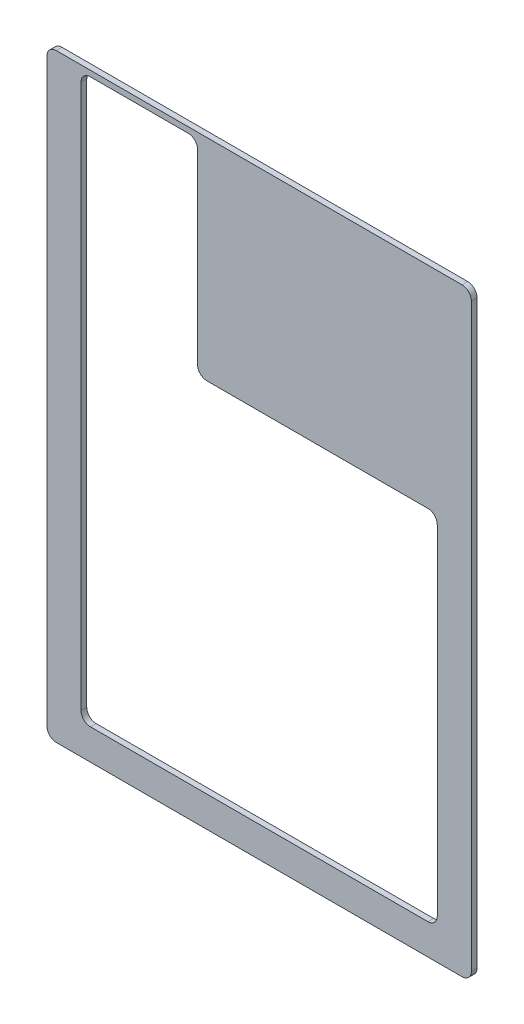
ISO-10303-21;
HEADER;
FILE_DESCRIPTION(('STEP AP214'),'2;1');
FILE_NAME('part.step','',(''),(''),'','','');
FILE_SCHEMA(('AUTOMOTIVE_DESIGN { 1 0 10303 214 1 1 1 1 }'));
ENDSEC;
DATA;
#1=APPLICATION_CONTEXT('core data for automotive mechanical design processes');
#2=APPLICATION_PROTOCOL_DEFINITION('international standard','automotive_design',2000,#1);
#3=PRODUCT_CONTEXT('',#1,'mechanical');
#4=PRODUCT('Part','Part','',(#3));
#5=PRODUCT_RELATED_PRODUCT_CATEGORY('part','',(#4));
#6=PRODUCT_DEFINITION_FORMATION('','',#4);
#7=PRODUCT_DEFINITION_CONTEXT('part definition',#1,'design');
#8=PRODUCT_DEFINITION('design','',#6,#7);
#9=PRODUCT_DEFINITION_SHAPE('','',#8);
#10=(LENGTH_UNIT() NAMED_UNIT(*) SI_UNIT(.MILLI.,.METRE.));
#11=(NAMED_UNIT(*) PLANE_ANGLE_UNIT() SI_UNIT($,.RADIAN.));
#12=(NAMED_UNIT(*) SI_UNIT($,.STERADIAN.) SOLID_ANGLE_UNIT());
#13=UNCERTAINTY_MEASURE_WITH_UNIT(LENGTH_MEASURE(1.E-05),#10,'distance_accuracy_value','');
#14=(GEOMETRIC_REPRESENTATION_CONTEXT(3) GLOBAL_UNCERTAINTY_ASSIGNED_CONTEXT((#13)) GLOBAL_UNIT_ASSIGNED_CONTEXT((#10,
#11,#12)) REPRESENTATION_CONTEXT('',''));
#15=CARTESIAN_POINT('',(0.,0.,0.));
#16=DIRECTION('',(0.,0.,1.));
#17=DIRECTION('',(1.,0.,0.));
#18=AXIS2_PLACEMENT_3D('',#15,#16,#17);
#19=CARTESIAN_POINT('',(161.925,-228.6,4.3434));
#20=DIRECTION('',(-1.,0.,0.));
#21=DIRECTION('',(0.,0.,1.));
#22=AXIS2_PLACEMENT_3D('',#19,#20,#21);
#23=PLANE('',#22);
#24=DIRECTION('',(0.,1.,0.));
#25=VECTOR('',#24,1.);
#26=CARTESIAN_POINT('',(161.925,-228.6,4.3434));
#27=LINE('',#26,#25);
#28=CARTESIAN_POINT('',(161.925,-221.45625,4.3434));
#29=VERTEX_POINT('',#28);
#30=CARTESIAN_POINT('',(161.925,221.45625,4.3434));
#31=VERTEX_POINT('',#30);
#32=EDGE_CURVE('E214',#29,#31,#27,.T.);
#33=ORIENTED_EDGE('',*,*,#32,.F.);
#34=DIRECTION('',(0.,0.,-1.));
#35=VECTOR('',#34,1.);
#36=CARTESIAN_POINT('',(161.925,-221.45625,4.3434));
#37=LINE('',#36,#35);
#38=CARTESIAN_POINT('',(161.925,-221.45625,0.));
#39=VERTEX_POINT('',#38);
#40=EDGE_CURVE('E276',#29,#39,#37,.T.);
#41=ORIENTED_EDGE('',*,*,#40,.T.);
#42=DIRECTION('',(0.,1.,0.));
#43=VECTOR('',#42,1.);
#44=CARTESIAN_POINT('',(161.925,-228.6,0.));
#45=LINE('',#44,#43);
#46=CARTESIAN_POINT('',(161.925,221.45625,0.));
#47=VERTEX_POINT('',#46);
#48=EDGE_CURVE('E227',#39,#47,#45,.T.);
#49=ORIENTED_EDGE('',*,*,#48,.T.);
#50=DIRECTION('',(0.,0.,-1.));
#51=VECTOR('',#50,1.);
#52=CARTESIAN_POINT('',(161.925,221.45625,4.3434));
#53=LINE('',#52,#51);
#54=EDGE_CURVE('E274',#47,#31,#53,.F.);
#55=ORIENTED_EDGE('',*,*,#54,.T.);
#56=EDGE_LOOP('',(#33,#41,#49,#55));
#57=FACE_BOUND('',#56,.T.);
#58=ADVANCED_FACE('F33',(#57),#23,.F.);
#59=CARTESIAN_POINT('',(-161.925,228.6,4.3434));
#60=DIRECTION('',(0.,-1.,0.));
#61=DIRECTION('',(0.,0.,-1.));
#62=AXIS2_PLACEMENT_3D('',#59,#60,#61);
#63=PLANE('',#62);
#64=DIRECTION('',(-1.,0.,0.));
#65=VECTOR('',#64,1.);
#66=CARTESIAN_POINT('',(-161.925,228.6,4.3434));
#67=LINE('',#66,#65);
#68=CARTESIAN_POINT('',(154.78125,228.6,4.3434));
#69=VERTEX_POINT('',#68);
#70=CARTESIAN_POINT('',(-154.78125,228.6,4.3434));
#71=VERTEX_POINT('',#70);
#72=EDGE_CURVE('E217',#69,#71,#67,.T.);
#73=ORIENTED_EDGE('',*,*,#72,.F.);
#74=DIRECTION('',(0.,0.,-1.));
#75=VECTOR('',#74,1.);
#76=CARTESIAN_POINT('',(154.78125,228.6,4.3434));
#77=LINE('',#76,#75);
#78=CARTESIAN_POINT('',(154.78125,228.6,0.));
#79=VERTEX_POINT('',#78);
#80=EDGE_CURVE('E180',#69,#79,#77,.T.);
#81=ORIENTED_EDGE('',*,*,#80,.T.);
#82=DIRECTION('',(-1.,0.,0.));
#83=VECTOR('',#82,1.);
#84=CARTESIAN_POINT('',(-161.925,228.6,0.));
#85=LINE('',#84,#83);
#86=CARTESIAN_POINT('',(-154.78125,228.6,0.));
#87=VERTEX_POINT('',#86);
#88=EDGE_CURVE('E230',#79,#87,#85,.T.);
#89=ORIENTED_EDGE('',*,*,#88,.T.);
#90=DIRECTION('',(0.,0.,-1.));
#91=VECTOR('',#90,1.);
#92=CARTESIAN_POINT('',(-154.78125,228.6,4.3434));
#93=LINE('',#92,#91);
#94=EDGE_CURVE('E279',#87,#71,#93,.F.);
#95=ORIENTED_EDGE('',*,*,#94,.T.);
#96=EDGE_LOOP('',(#73,#81,#89,#95));
#97=FACE_BOUND('',#96,.T.);
#98=ADVANCED_FACE('F335',(#97),#63,.F.);
#99=CARTESIAN_POINT('',(-161.925,-228.6,4.3434));
#100=DIRECTION('',(1.,0.,0.));
#101=DIRECTION('',(0.,0.,-1.));
#102=AXIS2_PLACEMENT_3D('',#99,#100,#101);
#103=PLANE('',#102);
#104=DIRECTION('',(0.,-1.,0.));
#105=VECTOR('',#104,1.);
#106=CARTESIAN_POINT('',(-161.925,-228.6,0.));
#107=LINE('',#106,#105);
#108=CARTESIAN_POINT('',(-161.925,221.45625,0.));
#109=VERTEX_POINT('',#108);
#110=CARTESIAN_POINT('',(-161.925,-221.45625,0.));
#111=VERTEX_POINT('',#110);
#112=EDGE_CURVE('E233',#109,#111,#107,.T.);
#113=ORIENTED_EDGE('',*,*,#112,.T.);
#114=DIRECTION('',(0.,0.,-1.));
#115=VECTOR('',#114,1.);
#116=CARTESIAN_POINT('',(-161.925,-221.45625,4.3434));
#117=LINE('',#116,#115);
#118=CARTESIAN_POINT('',(-161.925,-221.45625,4.3434));
#119=VERTEX_POINT('',#118);
#120=EDGE_CURVE('E264',#111,#119,#117,.F.);
#121=ORIENTED_EDGE('',*,*,#120,.T.);
#122=DIRECTION('',(0.,-1.,0.));
#123=VECTOR('',#122,1.);
#124=CARTESIAN_POINT('',(-161.925,-228.6,4.3434));
#125=LINE('',#124,#123);
#126=CARTESIAN_POINT('',(-161.925,221.45625,4.3434));
#127=VERTEX_POINT('',#126);
#128=EDGE_CURVE('E221',#127,#119,#125,.T.);
#129=ORIENTED_EDGE('',*,*,#128,.F.);
#130=DIRECTION('',(0.,0.,-1.));
#131=VECTOR('',#130,1.);
#132=CARTESIAN_POINT('',(-161.925,221.45625,4.3434));
#133=LINE('',#132,#131);
#134=EDGE_CURVE('E261',#127,#109,#133,.T.);
#135=ORIENTED_EDGE('',*,*,#134,.T.);
#136=EDGE_LOOP('',(#113,#121,#129,#135));
#137=FACE_BOUND('',#136,.T.);
#138=ADVANCED_FACE('F341',(#137),#103,.F.);
#139=CARTESIAN_POINT('',(-161.925,-228.6,4.3434));
#140=DIRECTION('',(0.,1.,0.));
#141=DIRECTION('',(0.,0.,1.));
#142=AXIS2_PLACEMENT_3D('',#139,#140,#141);
#143=PLANE('',#142);
#144=DIRECTION('',(1.,0.,0.));
#145=VECTOR('',#144,1.);
#146=CARTESIAN_POINT('',(-161.925,-228.6,4.3434));
#147=LINE('',#146,#145);
#148=CARTESIAN_POINT('',(-154.78125,-228.6,4.3434));
#149=VERTEX_POINT('',#148);
#150=CARTESIAN_POINT('',(154.78125,-228.6,4.3434));
#151=VERTEX_POINT('',#150);
#152=EDGE_CURVE('E224',#149,#151,#147,.T.);
#153=ORIENTED_EDGE('',*,*,#152,.F.);
#154=DIRECTION('',(0.,0.,-1.));
#155=VECTOR('',#154,1.);
#156=CARTESIAN_POINT('',(-154.78125,-228.6,4.3434));
#157=LINE('',#156,#155);
#158=CARTESIAN_POINT('',(-154.78125,-228.6,0.));
#159=VERTEX_POINT('',#158);
#160=EDGE_CURVE('E250',#149,#159,#157,.T.);
#161=ORIENTED_EDGE('',*,*,#160,.T.);
#162=DIRECTION('',(1.,0.,0.));
#163=VECTOR('',#162,1.);
#164=CARTESIAN_POINT('',(-161.925,-228.6,0.));
#165=LINE('',#164,#163);
#166=CARTESIAN_POINT('',(154.78125,-228.6,0.));
#167=VERTEX_POINT('',#166);
#168=EDGE_CURVE('E218',#159,#167,#165,.T.);
#169=ORIENTED_EDGE('',*,*,#168,.T.);
#170=DIRECTION('',(0.,0.,-1.));
#171=VECTOR('',#170,1.);
#172=CARTESIAN_POINT('',(154.78125,-228.6,4.3434));
#173=LINE('',#172,#171);
#174=EDGE_CURVE('E248',#167,#151,#173,.F.);
#175=ORIENTED_EDGE('',*,*,#174,.T.);
#176=EDGE_LOOP('',(#153,#161,#169,#175));
#177=FACE_BOUND('',#176,.T.);
#178=ADVANCED_FACE('F392',(#177),#143,.F.);
#179=CARTESIAN_POINT('',(0.,0.,4.3434));
#180=DIRECTION('',(0.,0.,-1.));
#181=DIRECTION('',(-1.,0.,0.));
#182=AXIS2_PLACEMENT_3D('',#179,#180,#181);
#183=PLANE('',#182);
#184=DIRECTION('',(0.,1.,0.));
#185=VECTOR('',#184,1.);
#186=CARTESIAN_POINT('',(-46.9900000000001,39.34527567184,4.3434));
#187=LINE('',#186,#185);
#188=CARTESIAN_POINT('',(-46.9900000000001,74.9617500000001,4.3434));
#189=VERTEX_POINT('',#188);
#190=CARTESIAN_POINT('',(-46.9900000000001,217.11285,4.3434));
#191=VERTEX_POINT('',#190);
#192=EDGE_CURVE('E508',#189,#191,#187,.T.);
#193=ORIENTED_EDGE('',*,*,#192,.F.);
#194=CARTESIAN_POINT('',(-39.8462500000001,74.9617500000001,4.3434));
#195=DIRECTION('',(0.,0.,-1.));
#196=DIRECTION('',(-1.,0.,0.));
#197=AXIS2_PLACEMENT_3D('',#194,#195,#196);
#198=CIRCLE('',#197,7.14375);
#199=CARTESIAN_POINT('',(-39.8462500000001,67.8180000000001,4.3434));
#200=VERTEX_POINT('',#199);
#201=EDGE_CURVE('E301',#189,#200,#198,.F.);
#202=ORIENTED_EDGE('',*,*,#201,.T.);
#203=DIRECTION('',(-1.,0.,0.));
#204=VECTOR('',#203,1.);
#205=CARTESIAN_POINT('',(-135.89,67.818,4.3434));
#206=LINE('',#205,#204);
#207=CARTESIAN_POINT('',(128.74625,67.8180000000002,4.3434));
#208=VERTEX_POINT('',#207);
#209=EDGE_CURVE('E198',#208,#200,#206,.T.);
#210=ORIENTED_EDGE('',*,*,#209,.F.);
#211=CARTESIAN_POINT('',(128.74625,60.6742500000002,4.3434));
#212=DIRECTION('',(0.,0.,-1.));
#213=DIRECTION('',(-1.,0.,0.));
#214=AXIS2_PLACEMENT_3D('',#211,#212,#213);
#215=CIRCLE('',#214,7.14375);
#216=CARTESIAN_POINT('',(135.89,60.6742500000001,4.3434));
#217=VERTEX_POINT('',#216);
#218=EDGE_CURVE('E197',#208,#217,#215,.T.);
#219=ORIENTED_EDGE('',*,*,#218,.T.);
#220=DIRECTION('',(0.,1.,0.));
#221=VECTOR('',#220,1.);
#222=CARTESIAN_POINT('',(135.89,-205.232,4.3434));
#223=LINE('',#222,#221);
#224=CARTESIAN_POINT('',(135.89,-198.08825,4.3434));
#225=VERTEX_POINT('',#224);
#226=EDGE_CURVE('E186',#225,#217,#223,.T.);
#227=ORIENTED_EDGE('',*,*,#226,.F.);
#228=CARTESIAN_POINT('',(128.74625,-198.08825,4.3434));
#229=DIRECTION('',(0.,0.,-1.));
#230=DIRECTION('',(-1.,0.,0.));
#231=AXIS2_PLACEMENT_3D('',#228,#229,#230);
#232=CIRCLE('',#231,7.14375);
#233=CARTESIAN_POINT('',(128.74625,-205.232,4.3434));
#234=VERTEX_POINT('',#233);
#235=EDGE_CURVE('E170',#225,#234,#232,.T.);
#236=ORIENTED_EDGE('',*,*,#235,.T.);
#237=DIRECTION('',(1.,0.,0.));
#238=VECTOR('',#237,1.);
#239=CARTESIAN_POINT('',(-135.89,-205.232,4.3434));
#240=LINE('',#239,#238);
#241=CARTESIAN_POINT('',(-128.74625,-205.232,4.3434));
#242=VERTEX_POINT('',#241);
#243=EDGE_CURVE('E212',#242,#234,#240,.T.);
#244=ORIENTED_EDGE('',*,*,#243,.F.);
#245=CARTESIAN_POINT('',(-128.74625,-198.08825,4.3434));
#246=DIRECTION('',(0.,0.,-1.));
#247=DIRECTION('',(-1.,0.,0.));
#248=AXIS2_PLACEMENT_3D('',#245,#246,#247);
#249=CIRCLE('',#248,7.14375);
#250=CARTESIAN_POINT('',(-135.89,-198.08825,4.3434));
#251=VERTEX_POINT('',#250);
#252=EDGE_CURVE('E287',#242,#251,#249,.T.);
#253=ORIENTED_EDGE('',*,*,#252,.T.);
#254=DIRECTION('',(0.,-1.,0.));
#255=VECTOR('',#254,1.);
#256=CARTESIAN_POINT('',(-135.89,-205.232,4.3434));
#257=LINE('',#256,#255);
#258=CARTESIAN_POINT('',(-135.89,217.11285,4.3434));
#259=VERTEX_POINT('',#258);
#260=EDGE_CURVE('E202',#259,#251,#257,.T.);
#261=ORIENTED_EDGE('',*,*,#260,.F.);
#262=CARTESIAN_POINT('',(-128.74625,217.11285,4.3434));
#263=DIRECTION('',(0.,0.,-1.));
#264=DIRECTION('',(-1.,0.,0.));
#265=AXIS2_PLACEMENT_3D('',#262,#263,#264);
#266=CIRCLE('',#265,7.14375);
#267=CARTESIAN_POINT('',(-128.74625,224.2566,4.3434));
#268=VERTEX_POINT('',#267);
#269=EDGE_CURVE('E41',#259,#268,#266,.T.);
#270=ORIENTED_EDGE('',*,*,#269,.T.);
#271=DIRECTION('',(-1.,0.,0.));
#272=VECTOR('',#271,1.);
#273=CARTESIAN_POINT('',(-135.89,224.2566,4.3434));
#274=LINE('',#273,#272);
#275=CARTESIAN_POINT('',(-54.1337500000001,224.2566,4.3434));
#276=VERTEX_POINT('',#275);
#277=EDGE_CURVE('E506',#276,#268,#274,.T.);
#278=ORIENTED_EDGE('',*,*,#277,.F.);
#279=CARTESIAN_POINT('',(-54.1337500000001,217.11285,4.3434));
#280=DIRECTION('',(0.,0.,-1.));
#281=DIRECTION('',(-1.,0.,0.));
#282=AXIS2_PLACEMENT_3D('',#279,#280,#281);
#283=CIRCLE('',#282,7.14375);
#284=EDGE_CURVE('E55',#276,#191,#283,.T.);
#285=ORIENTED_EDGE('',*,*,#284,.T.);
#286=EDGE_LOOP('',(#193,#202,#210,#219,#227,#236,#244,#253,#261,#270,#278,#285));
#287=FACE_BOUND('',#286,.T.);
#288=ORIENTED_EDGE('',*,*,#128,.T.);
#289=CARTESIAN_POINT('',(-154.78125,-221.45625,4.3434));
#290=DIRECTION('',(0.,0.,-1.));
#291=DIRECTION('',(-1.,0.,0.));
#292=AXIS2_PLACEMENT_3D('',#289,#290,#291);
#293=CIRCLE('',#292,7.14375);
#294=EDGE_CURVE('E272',#119,#149,#293,.F.);
#295=ORIENTED_EDGE('',*,*,#294,.T.);
#296=ORIENTED_EDGE('',*,*,#152,.T.);
#297=CARTESIAN_POINT('',(154.78125,-221.45625,4.3434));
#298=DIRECTION('',(0.,0.,-1.));
#299=DIRECTION('',(-1.,0.,0.));
#300=AXIS2_PLACEMENT_3D('',#297,#298,#299);
#301=CIRCLE('',#300,7.14375);
#302=EDGE_CURVE('E270',#151,#29,#301,.F.);
#303=ORIENTED_EDGE('',*,*,#302,.T.);
#304=ORIENTED_EDGE('',*,*,#32,.T.);
#305=CARTESIAN_POINT('',(154.78125,221.45625,4.3434));
#306=DIRECTION('',(0.,0.,-1.));
#307=DIRECTION('',(-1.,0.,0.));
#308=AXIS2_PLACEMENT_3D('',#305,#306,#307);
#309=CIRCLE('',#308,7.14375);
#310=EDGE_CURVE('E268',#31,#69,#309,.F.);
#311=ORIENTED_EDGE('',*,*,#310,.T.);
#312=ORIENTED_EDGE('',*,*,#72,.T.);
#313=CARTESIAN_POINT('',(-154.78125,221.45625,4.3434));
#314=DIRECTION('',(0.,0.,-1.));
#315=DIRECTION('',(-1.,0.,0.));
#316=AXIS2_PLACEMENT_3D('',#313,#314,#315);
#317=CIRCLE('',#316,7.14375);
#318=EDGE_CURVE('E266',#71,#127,#317,.F.);
#319=ORIENTED_EDGE('',*,*,#318,.T.);
#320=EDGE_LOOP('',(#288,#295,#296,#303,#304,#311,#312,#319));
#321=FACE_BOUND('',#320,.T.);
#322=ADVANCED_FACE('F194',(#287,#321),#183,.F.);
#323=CARTESIAN_POINT('',(0.,0.,0.));
#324=DIRECTION('',(0.,0.,-1.));
#325=DIRECTION('',(-1.,0.,0.));
#326=AXIS2_PLACEMENT_3D('',#323,#324,#325);
#327=PLANE('',#326);
#328=DIRECTION('',(-1.,0.,0.));
#329=VECTOR('',#328,1.);
#330=CARTESIAN_POINT('',(-135.89,67.818,0.));
#331=LINE('',#330,#329);
#332=CARTESIAN_POINT('',(128.74625,67.8180000000002,0.));
#333=VERTEX_POINT('',#332);
#334=CARTESIAN_POINT('',(-39.8462500000001,67.8180000000001,0.));
#335=VERTEX_POINT('',#334);
#336=EDGE_CURVE('E502',#333,#335,#331,.T.);
#337=ORIENTED_EDGE('',*,*,#336,.T.);
#338=CARTESIAN_POINT('',(-39.8462500000001,74.9617500000001,0.));
#339=DIRECTION('',(0.,0.,-1.));
#340=DIRECTION('',(-1.,0.,0.));
#341=AXIS2_PLACEMENT_3D('',#338,#339,#340);
#342=CIRCLE('',#341,7.14375);
#343=CARTESIAN_POINT('',(-46.9900000000001,74.9617500000001,0.));
#344=VERTEX_POINT('',#343);
#345=EDGE_CURVE('E295',#335,#344,#342,.T.);
#346=ORIENTED_EDGE('',*,*,#345,.T.);
#347=DIRECTION('',(0.,1.,0.));
#348=VECTOR('',#347,1.);
#349=CARTESIAN_POINT('',(-46.9900000000001,39.34527567184,0.));
#350=LINE('',#349,#348);
#351=CARTESIAN_POINT('',(-46.9900000000001,217.11285,0.));
#352=VERTEX_POINT('',#351);
#353=EDGE_CURVE('E205',#344,#352,#350,.T.);
#354=ORIENTED_EDGE('',*,*,#353,.T.);
#355=CARTESIAN_POINT('',(-54.1337500000001,217.11285,0.));
#356=DIRECTION('',(0.,0.,-1.));
#357=DIRECTION('',(-1.,0.,0.));
#358=AXIS2_PLACEMENT_3D('',#355,#356,#357);
#359=CIRCLE('',#358,7.14375);
#360=CARTESIAN_POINT('',(-54.1337500000001,224.2566,0.));
#361=VERTEX_POINT('',#360);
#362=EDGE_CURVE('E311',#352,#361,#359,.F.);
#363=ORIENTED_EDGE('',*,*,#362,.T.);
#364=DIRECTION('',(-1.,0.,0.));
#365=VECTOR('',#364,1.);
#366=CARTESIAN_POINT('',(-135.89,224.2566,0.));
#367=LINE('',#366,#365);
#368=CARTESIAN_POINT('',(-128.74625,224.2566,0.));
#369=VERTEX_POINT('',#368);
#370=EDGE_CURVE('E199',#361,#369,#367,.T.);
#371=ORIENTED_EDGE('',*,*,#370,.T.);
#372=CARTESIAN_POINT('',(-128.74625,217.11285,0.));
#373=DIRECTION('',(0.,0.,-1.));
#374=DIRECTION('',(-1.,0.,0.));
#375=AXIS2_PLACEMENT_3D('',#372,#373,#374);
#376=CIRCLE('',#375,7.14375);
#377=CARTESIAN_POINT('',(-135.89,217.11285,0.));
#378=VERTEX_POINT('',#377);
#379=EDGE_CURVE('E11',#369,#378,#376,.F.);
#380=ORIENTED_EDGE('',*,*,#379,.T.);
#381=DIRECTION('',(0.,-1.,0.));
#382=VECTOR('',#381,1.);
#383=CARTESIAN_POINT('',(-135.89,-205.232,0.));
#384=LINE('',#383,#382);
#385=CARTESIAN_POINT('',(-135.89,-198.08825,0.));
#386=VERTEX_POINT('',#385);
#387=EDGE_CURVE('E500',#378,#386,#384,.T.);
#388=ORIENTED_EDGE('',*,*,#387,.T.);
#389=CARTESIAN_POINT('',(-128.74625,-198.08825,0.));
#390=DIRECTION('',(0.,0.,-1.));
#391=DIRECTION('',(-1.,0.,0.));
#392=AXIS2_PLACEMENT_3D('',#389,#390,#391);
#393=CIRCLE('',#392,7.14375);
#394=CARTESIAN_POINT('',(-128.74625,-205.232,0.));
#395=VERTEX_POINT('',#394);
#396=EDGE_CURVE('E290',#386,#395,#393,.F.);
#397=ORIENTED_EDGE('',*,*,#396,.T.);
#398=DIRECTION('',(1.,0.,0.));
#399=VECTOR('',#398,1.);
#400=CARTESIAN_POINT('',(-135.89,-205.232,0.));
#401=LINE('',#400,#399);
#402=CARTESIAN_POINT('',(128.74625,-205.232,0.));
#403=VERTEX_POINT('',#402);
#404=EDGE_CURVE('E208',#395,#403,#401,.T.);
#405=ORIENTED_EDGE('',*,*,#404,.T.);
#406=CARTESIAN_POINT('',(128.74625,-198.08825,0.));
#407=DIRECTION('',(0.,0.,-1.));
#408=DIRECTION('',(-1.,0.,0.));
#409=AXIS2_PLACEMENT_3D('',#406,#407,#408);
#410=CIRCLE('',#409,7.14375);
#411=CARTESIAN_POINT('',(135.89,-198.08825,0.));
#412=VERTEX_POINT('',#411);
#413=EDGE_CURVE('E179',#403,#412,#410,.F.);
#414=ORIENTED_EDGE('',*,*,#413,.T.);
#415=DIRECTION('',(0.,1.,0.));
#416=VECTOR('',#415,1.);
#417=CARTESIAN_POINT('',(135.89,-205.232,0.));
#418=LINE('',#417,#416);
#419=CARTESIAN_POINT('',(135.89,60.6742500000001,0.));
#420=VERTEX_POINT('',#419);
#421=EDGE_CURVE('E189',#412,#420,#418,.T.);
#422=ORIENTED_EDGE('',*,*,#421,.T.);
#423=CARTESIAN_POINT('',(128.74625,60.6742500000002,0.));
#424=DIRECTION('',(0.,0.,-1.));
#425=DIRECTION('',(-1.,0.,0.));
#426=AXIS2_PLACEMENT_3D('',#423,#424,#425);
#427=CIRCLE('',#426,7.14375);
#428=EDGE_CURVE('E285',#420,#333,#427,.F.);
#429=ORIENTED_EDGE('',*,*,#428,.T.);
#430=EDGE_LOOP('',(#337,#346,#354,#363,#371,#380,#388,#397,#405,#414,#422,#429));
#431=FACE_BOUND('',#430,.T.);
#432=ORIENTED_EDGE('',*,*,#168,.F.);
#433=CARTESIAN_POINT('',(-154.78125,-221.45625,0.));
#434=DIRECTION('',(0.,0.,-1.));
#435=DIRECTION('',(-1.,0.,0.));
#436=AXIS2_PLACEMENT_3D('',#433,#434,#435);
#437=CIRCLE('',#436,7.14375);
#438=EDGE_CURVE('E259',#159,#111,#437,.T.);
#439=ORIENTED_EDGE('',*,*,#438,.T.);
#440=ORIENTED_EDGE('',*,*,#112,.F.);
#441=CARTESIAN_POINT('',(-154.78125,221.45625,0.));
#442=DIRECTION('',(0.,0.,-1.));
#443=DIRECTION('',(-1.,0.,0.));
#444=AXIS2_PLACEMENT_3D('',#441,#442,#443);
#445=CIRCLE('',#444,7.14375);
#446=EDGE_CURVE('E253',#109,#87,#445,.T.);
#447=ORIENTED_EDGE('',*,*,#446,.T.);
#448=ORIENTED_EDGE('',*,*,#88,.F.);
#449=CARTESIAN_POINT('',(154.78125,221.45625,0.));
#450=DIRECTION('',(0.,0.,-1.));
#451=DIRECTION('',(-1.,0.,0.));
#452=AXIS2_PLACEMENT_3D('',#449,#450,#451);
#453=CIRCLE('',#452,7.14375);
#454=EDGE_CURVE('E255',#79,#47,#453,.T.);
#455=ORIENTED_EDGE('',*,*,#454,.T.);
#456=ORIENTED_EDGE('',*,*,#48,.F.);
#457=CARTESIAN_POINT('',(154.78125,-221.45625,0.));
#458=DIRECTION('',(0.,0.,-1.));
#459=DIRECTION('',(-1.,0.,0.));
#460=AXIS2_PLACEMENT_3D('',#457,#458,#459);
#461=CIRCLE('',#460,7.14375);
#462=EDGE_CURVE('E257',#39,#167,#461,.T.);
#463=ORIENTED_EDGE('',*,*,#462,.T.);
#464=EDGE_LOOP('',(#432,#439,#440,#447,#448,#455,#456,#463));
#465=FACE_BOUND('',#464,.T.);
#466=ADVANCED_FACE('F317',(#431,#465),#327,.T.);
#467=CARTESIAN_POINT('',(135.89,-205.232,0.));
#468=DIRECTION('',(1.,0.,0.));
#469=DIRECTION('',(0.,1.,0.));
#470=AXIS2_PLACEMENT_3D('',#467,#468,#469);
#471=PLANE('',#470);
#472=ORIENTED_EDGE('',*,*,#421,.F.);
#473=DIRECTION('',(0.,0.,1.));
#474=VECTOR('',#473,1.);
#475=CARTESIAN_POINT('',(135.89,-198.08825,4.3434));
#476=LINE('',#475,#474);
#477=EDGE_CURVE('E174',#412,#225,#476,.T.);
#478=ORIENTED_EDGE('',*,*,#477,.T.);
#479=ORIENTED_EDGE('',*,*,#226,.T.);
#480=DIRECTION('',(0.,0.,1.));
#481=VECTOR('',#480,1.);
#482=CARTESIAN_POINT('',(135.89,60.6742500000002,0.));
#483=LINE('',#482,#481);
#484=EDGE_CURVE('E191',#217,#420,#483,.F.);
#485=ORIENTED_EDGE('',*,*,#484,.T.);
#486=EDGE_LOOP('',(#472,#478,#479,#485));
#487=FACE_BOUND('',#486,.T.);
#488=ADVANCED_FACE('F185',(#487),#471,.F.);
#489=CARTESIAN_POINT('',(-135.89,-205.232,0.));
#490=DIRECTION('',(0.,-1.,0.));
#491=DIRECTION('',(1.,0.,0.));
#492=AXIS2_PLACEMENT_3D('',#489,#490,#491);
#493=PLANE('',#492);
#494=ORIENTED_EDGE('',*,*,#243,.T.);
#495=DIRECTION('',(0.,0.,1.));
#496=VECTOR('',#495,1.);
#497=CARTESIAN_POINT('',(128.74625,-205.232,0.));
#498=LINE('',#497,#496);
#499=EDGE_CURVE('E175',#234,#403,#498,.F.);
#500=ORIENTED_EDGE('',*,*,#499,.T.);
#501=ORIENTED_EDGE('',*,*,#404,.F.);
#502=DIRECTION('',(0.,0.,1.));
#503=VECTOR('',#502,1.);
#504=CARTESIAN_POINT('',(-128.74625,-205.232,4.3434));
#505=LINE('',#504,#503);
#506=EDGE_CURVE('E190',#395,#242,#505,.T.);
#507=ORIENTED_EDGE('',*,*,#506,.T.);
#508=EDGE_LOOP('',(#494,#500,#501,#507));
#509=FACE_BOUND('',#508,.T.);
#510=ADVANCED_FACE('F407',(#509),#493,.F.);
#511=CARTESIAN_POINT('',(-135.89,-205.232,0.));
#512=DIRECTION('',(-1.,0.,0.));
#513=DIRECTION('',(0.,-1.,0.));
#514=AXIS2_PLACEMENT_3D('',#511,#512,#513);
#515=PLANE('',#514);
#516=ORIENTED_EDGE('',*,*,#387,.F.);
#517=DIRECTION('',(0.,0.,1.));
#518=VECTOR('',#517,1.);
#519=CARTESIAN_POINT('',(-135.89,217.11285,4.3434));
#520=LINE('',#519,#518);
#521=EDGE_CURVE('E307',#378,#259,#520,.T.);
#522=ORIENTED_EDGE('',*,*,#521,.T.);
#523=ORIENTED_EDGE('',*,*,#260,.T.);
#524=DIRECTION('',(0.,0.,1.));
#525=VECTOR('',#524,1.);
#526=CARTESIAN_POINT('',(-135.89,-198.08825,0.));
#527=LINE('',#526,#525);
#528=EDGE_CURVE('E245',#251,#386,#527,.F.);
#529=ORIENTED_EDGE('',*,*,#528,.T.);
#530=EDGE_LOOP('',(#516,#522,#523,#529));
#531=FACE_BOUND('',#530,.T.);
#532=ADVANCED_FACE('F439',(#531),#515,.F.);
#533=CARTESIAN_POINT('',(-135.89,67.818,0.));
#534=DIRECTION('',(0.,1.,0.));
#535=DIRECTION('',(-1.,0.,0.));
#536=AXIS2_PLACEMENT_3D('',#533,#534,#535);
#537=PLANE('',#536);
#538=ORIENTED_EDGE('',*,*,#209,.T.);
#539=DIRECTION('',(0.,0.,-1.));
#540=VECTOR('',#539,1.);
#541=CARTESIAN_POINT('',(-39.8462500000001,67.8180000000001,0.));
#542=LINE('',#541,#540);
#543=EDGE_CURVE('E292',#200,#335,#542,.T.);
#544=ORIENTED_EDGE('',*,*,#543,.T.);
#545=ORIENTED_EDGE('',*,*,#336,.F.);
#546=DIRECTION('',(0.,0.,1.));
#547=VECTOR('',#546,1.);
#548=CARTESIAN_POINT('',(128.74625,67.8180000000002,4.3434));
#549=LINE('',#548,#547);
#550=EDGE_CURVE('E242',#333,#208,#549,.T.);
#551=ORIENTED_EDGE('',*,*,#550,.T.);
#552=EDGE_LOOP('',(#538,#544,#545,#551));
#553=FACE_BOUND('',#552,.T.);
#554=ADVANCED_FACE('F350',(#553),#537,.F.);
#555=CARTESIAN_POINT('',(128.74625,-198.08825,0.));
#556=DIRECTION('',(0.,0.,-1.));
#557=DIRECTION('',(-1.,0.,0.));
#558=AXIS2_PLACEMENT_3D('',#555,#556,#557);
#559=CYLINDRICAL_SURFACE('',#558,7.14375);
#560=ORIENTED_EDGE('',*,*,#413,.F.);
#561=ORIENTED_EDGE('',*,*,#499,.F.);
#562=ORIENTED_EDGE('',*,*,#235,.F.);
#563=ORIENTED_EDGE('',*,*,#477,.F.);
#564=EDGE_LOOP('',(#560,#561,#562,#563));
#565=FACE_BOUND('',#564,.T.);
#566=ADVANCED_FACE('F173',(#565),#559,.F.);
#567=CARTESIAN_POINT('',(128.74625,60.6742500000002,0.));
#568=DIRECTION('',(0.,0.,-1.));
#569=DIRECTION('',(-1.,0.,0.));
#570=AXIS2_PLACEMENT_3D('',#567,#568,#569);
#571=CYLINDRICAL_SURFACE('',#570,7.14375);
#572=ORIENTED_EDGE('',*,*,#428,.F.);
#573=ORIENTED_EDGE('',*,*,#484,.F.);
#574=ORIENTED_EDGE('',*,*,#218,.F.);
#575=ORIENTED_EDGE('',*,*,#550,.F.);
#576=EDGE_LOOP('',(#572,#573,#574,#575));
#577=FACE_BOUND('',#576,.T.);
#578=ADVANCED_FACE('F349',(#577),#571,.F.);
#579=CARTESIAN_POINT('',(-128.74625,-198.08825,0.));
#580=DIRECTION('',(0.,0.,-1.));
#581=DIRECTION('',(-1.,0.,0.));
#582=AXIS2_PLACEMENT_3D('',#579,#580,#581);
#583=CYLINDRICAL_SURFACE('',#582,7.14375);
#584=ORIENTED_EDGE('',*,*,#396,.F.);
#585=ORIENTED_EDGE('',*,*,#528,.F.);
#586=ORIENTED_EDGE('',*,*,#252,.F.);
#587=ORIENTED_EDGE('',*,*,#506,.F.);
#588=EDGE_LOOP('',(#584,#585,#586,#587));
#589=FACE_BOUND('',#588,.T.);
#590=ADVANCED_FACE('F353',(#589),#583,.F.);
#591=CARTESIAN_POINT('',(-154.78125,-221.45625,4.3434));
#592=DIRECTION('',(0.,0.,-1.));
#593=DIRECTION('',(-1.,0.,0.));
#594=AXIS2_PLACEMENT_3D('',#591,#592,#593);
#595=CYLINDRICAL_SURFACE('',#594,7.14375);
#596=ORIENTED_EDGE('',*,*,#294,.F.);
#597=ORIENTED_EDGE('',*,*,#120,.F.);
#598=ORIENTED_EDGE('',*,*,#438,.F.);
#599=ORIENTED_EDGE('',*,*,#160,.F.);
#600=EDGE_LOOP('',(#596,#597,#598,#599));
#601=FACE_BOUND('',#600,.T.);
#602=ADVANCED_FACE('F357',(#601),#595,.T.);
#603=CARTESIAN_POINT('',(154.78125,-221.45625,4.3434));
#604=DIRECTION('',(0.,0.,-1.));
#605=DIRECTION('',(-1.,0.,0.));
#606=AXIS2_PLACEMENT_3D('',#603,#604,#605);
#607=CYLINDRICAL_SURFACE('',#606,7.14375);
#608=ORIENTED_EDGE('',*,*,#302,.F.);
#609=ORIENTED_EDGE('',*,*,#174,.F.);
#610=ORIENTED_EDGE('',*,*,#462,.F.);
#611=ORIENTED_EDGE('',*,*,#40,.F.);
#612=EDGE_LOOP('',(#608,#609,#610,#611));
#613=FACE_BOUND('',#612,.T.);
#614=ADVANCED_FACE('F361',(#613),#607,.T.);
#615=CARTESIAN_POINT('',(154.78125,221.45625,4.3434));
#616=DIRECTION('',(0.,0.,-1.));
#617=DIRECTION('',(-1.,0.,0.));
#618=AXIS2_PLACEMENT_3D('',#615,#616,#617);
#619=CYLINDRICAL_SURFACE('',#618,7.14375);
#620=ORIENTED_EDGE('',*,*,#310,.F.);
#621=ORIENTED_EDGE('',*,*,#54,.F.);
#622=ORIENTED_EDGE('',*,*,#454,.F.);
#623=ORIENTED_EDGE('',*,*,#80,.F.);
#624=EDGE_LOOP('',(#620,#621,#622,#623));
#625=FACE_BOUND('',#624,.T.);
#626=ADVANCED_FACE('F365',(#625),#619,.T.);
#627=CARTESIAN_POINT('',(-154.78125,221.45625,4.3434));
#628=DIRECTION('',(0.,0.,-1.));
#629=DIRECTION('',(-1.,0.,0.));
#630=AXIS2_PLACEMENT_3D('',#627,#628,#629);
#631=CYLINDRICAL_SURFACE('',#630,7.14375);
#632=ORIENTED_EDGE('',*,*,#318,.F.);
#633=ORIENTED_EDGE('',*,*,#94,.F.);
#634=ORIENTED_EDGE('',*,*,#446,.F.);
#635=ORIENTED_EDGE('',*,*,#134,.F.);
#636=EDGE_LOOP('',(#632,#633,#634,#635));
#637=FACE_BOUND('',#636,.T.);
#638=ADVANCED_FACE('F369',(#637),#631,.T.);
#639=CARTESIAN_POINT('',(-46.9900000000001,39.34527567184,0.));
#640=DIRECTION('',(1.,0.,0.));
#641=DIRECTION('',(0.,0.,-1.));
#642=AXIS2_PLACEMENT_3D('',#639,#640,#641);
#643=PLANE('',#642);
#644=ORIENTED_EDGE('',*,*,#353,.F.);
#645=DIRECTION('',(0.,0.,-1.));
#646=VECTOR('',#645,1.);
#647=CARTESIAN_POINT('',(-46.9900000000001,74.9617500000001,0.));
#648=LINE('',#647,#646);
#649=EDGE_CURVE('E299',#344,#189,#648,.F.);
#650=ORIENTED_EDGE('',*,*,#649,.T.);
#651=ORIENTED_EDGE('',*,*,#192,.T.);
#652=DIRECTION('',(0.,0.,1.));
#653=VECTOR('',#652,1.);
#654=CARTESIAN_POINT('',(-46.9900000000001,217.11285,0.));
#655=LINE('',#654,#653);
#656=EDGE_CURVE('E297',#191,#352,#655,.F.);
#657=ORIENTED_EDGE('',*,*,#656,.T.);
#658=EDGE_LOOP('',(#644,#650,#651,#657));
#659=FACE_BOUND('',#658,.T.);
#660=ADVANCED_FACE('F372',(#659),#643,.F.);
#661=CARTESIAN_POINT('',(-135.89,224.2566,0.));
#662=DIRECTION('',(0.,1.,0.));
#663=DIRECTION('',(0.,0.,1.));
#664=AXIS2_PLACEMENT_3D('',#661,#662,#663);
#665=PLANE('',#664);
#666=ORIENTED_EDGE('',*,*,#370,.F.);
#667=DIRECTION('',(0.,0.,1.));
#668=VECTOR('',#667,1.);
#669=CARTESIAN_POINT('',(-54.1337500000001,224.2566,4.3434));
#670=LINE('',#669,#668);
#671=EDGE_CURVE('E305',#361,#276,#670,.T.);
#672=ORIENTED_EDGE('',*,*,#671,.T.);
#673=ORIENTED_EDGE('',*,*,#277,.T.);
#674=DIRECTION('',(0.,0.,1.));
#675=VECTOR('',#674,1.);
#676=CARTESIAN_POINT('',(-128.74625,224.2566,0.));
#677=LINE('',#676,#675);
#678=EDGE_CURVE('E303',#268,#369,#677,.F.);
#679=ORIENTED_EDGE('',*,*,#678,.T.);
#680=EDGE_LOOP('',(#666,#672,#673,#679));
#681=FACE_BOUND('',#680,.T.);
#682=ADVANCED_FACE('F322',(#681),#665,.F.);
#683=CARTESIAN_POINT('',(-39.8462500000001,74.9617500000001,0.));
#684=DIRECTION('',(0.,0.,-1.));
#685=DIRECTION('',(-1.,0.,0.));
#686=AXIS2_PLACEMENT_3D('',#683,#684,#685);
#687=CYLINDRICAL_SURFACE('',#686,7.14375);
#688=ORIENTED_EDGE('',*,*,#201,.F.);
#689=ORIENTED_EDGE('',*,*,#649,.F.);
#690=ORIENTED_EDGE('',*,*,#345,.F.);
#691=ORIENTED_EDGE('',*,*,#543,.F.);
#692=EDGE_LOOP('',(#688,#689,#690,#691));
#693=FACE_BOUND('',#692,.T.);
#694=ADVANCED_FACE('F326',(#693),#687,.T.);
#695=CARTESIAN_POINT('',(-54.1337500000001,217.11285,0.));
#696=DIRECTION('',(0.,0.,-1.));
#697=DIRECTION('',(-1.,0.,0.));
#698=AXIS2_PLACEMENT_3D('',#695,#696,#697);
#699=CYLINDRICAL_SURFACE('',#698,7.14375);
#700=ORIENTED_EDGE('',*,*,#362,.F.);
#701=ORIENTED_EDGE('',*,*,#656,.F.);
#702=ORIENTED_EDGE('',*,*,#284,.F.);
#703=ORIENTED_EDGE('',*,*,#671,.F.);
#704=EDGE_LOOP('',(#700,#701,#702,#703));
#705=FACE_BOUND('',#704,.T.);
#706=ADVANCED_FACE('F324',(#705),#699,.F.);
#707=CARTESIAN_POINT('',(-128.74625,217.11285,0.));
#708=DIRECTION('',(0.,0.,-1.));
#709=DIRECTION('',(-1.,0.,0.));
#710=AXIS2_PLACEMENT_3D('',#707,#708,#709);
#711=CYLINDRICAL_SURFACE('',#710,7.14375);
#712=ORIENTED_EDGE('',*,*,#379,.F.);
#713=ORIENTED_EDGE('',*,*,#678,.F.);
#714=ORIENTED_EDGE('',*,*,#269,.F.);
#715=ORIENTED_EDGE('',*,*,#521,.F.);
#716=EDGE_LOOP('',(#712,#713,#714,#715));
#717=FACE_BOUND('',#716,.T.);
#718=ADVANCED_FACE('F35',(#717),#711,.F.);
#719=CLOSED_SHELL('',(#58,#98,#138,#178,#322,#466,#488,#510,#532,#554,#566,#578,#590,#602,#614,
#626,#638,#660,#682,#694,#706,#718));
#720=MANIFOLD_SOLID_BREP('B2',#719);
#721=ADVANCED_BREP_SHAPE_REPRESENTATION('',(#18,#720),#14);
#722=SHAPE_DEFINITION_REPRESENTATION(#9,#721);
ENDSEC;
END-ISO-10303-21;
